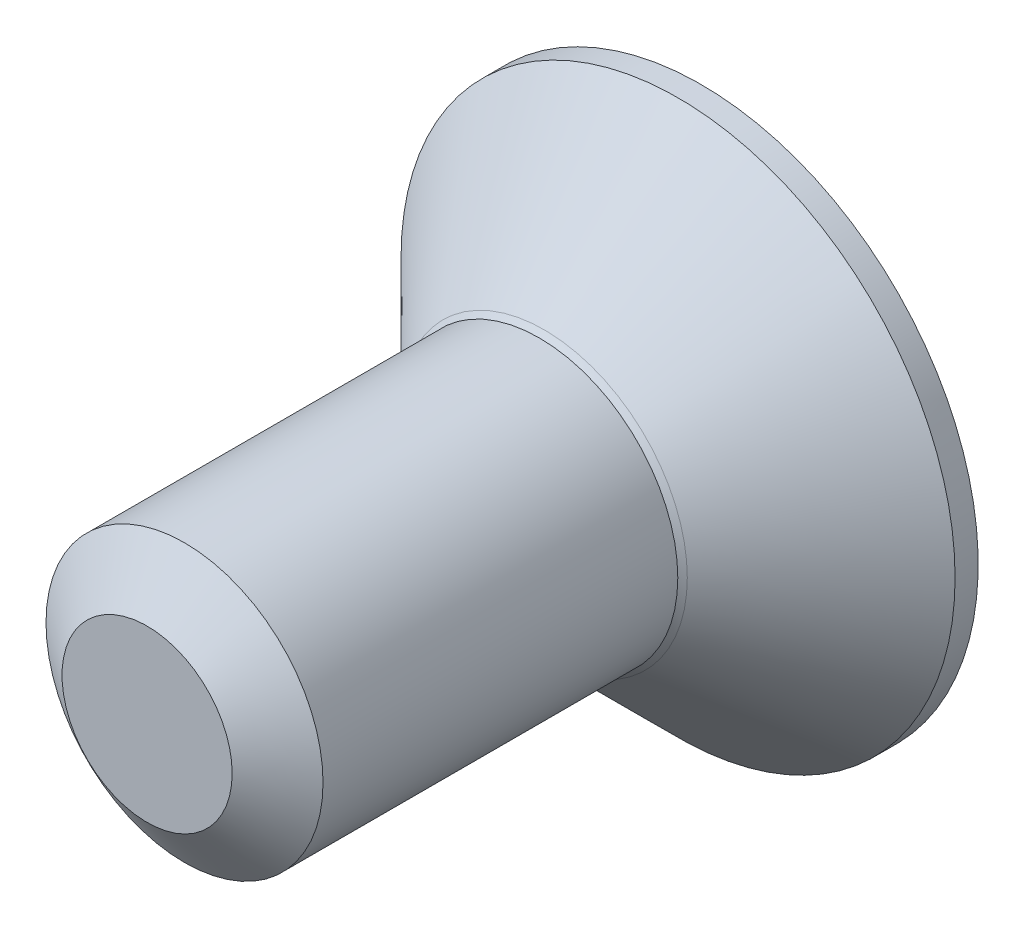
ISO-10303-21;
HEADER;
FILE_DESCRIPTION(('STEP AP214'),'2;1');
FILE_NAME('part.step','',(''),(''),'','','');
FILE_SCHEMA(('AUTOMOTIVE_DESIGN { 1 0 10303 214 1 1 1 1 }'));
ENDSEC;
DATA;
#1=APPLICATION_CONTEXT('core data for automotive mechanical design processes');
#2=APPLICATION_PROTOCOL_DEFINITION('international standard','automotive_design',2000,#1);
#3=PRODUCT_CONTEXT('',#1,'mechanical');
#4=PRODUCT('Part','Part','',(#3));
#5=PRODUCT_RELATED_PRODUCT_CATEGORY('part','',(#4));
#6=PRODUCT_DEFINITION_FORMATION('','',#4);
#7=PRODUCT_DEFINITION_CONTEXT('part definition',#1,'design');
#8=PRODUCT_DEFINITION('design','',#6,#7);
#9=PRODUCT_DEFINITION_SHAPE('','',#8);
#10=(LENGTH_UNIT() NAMED_UNIT(*) SI_UNIT(.MILLI.,.METRE.));
#11=(NAMED_UNIT(*) PLANE_ANGLE_UNIT() SI_UNIT($,.RADIAN.));
#12=(NAMED_UNIT(*) SI_UNIT($,.STERADIAN.) SOLID_ANGLE_UNIT());
#13=UNCERTAINTY_MEASURE_WITH_UNIT(LENGTH_MEASURE(1.E-05),#10,'distance_accuracy_value','');
#14=(GEOMETRIC_REPRESENTATION_CONTEXT(3) GLOBAL_UNCERTAINTY_ASSIGNED_CONTEXT((#13)) GLOBAL_UNIT_ASSIGNED_CONTEXT((#10,
#11,#12)) REPRESENTATION_CONTEXT('',''));
#15=CARTESIAN_POINT('',(0.,0.,0.));
#16=DIRECTION('',(0.,0.,1.));
#17=DIRECTION('',(1.,0.,0.));
#18=AXIS2_PLACEMENT_3D('',#15,#16,#17);
#19=CARTESIAN_POINT('',(0.,0.,-6.));
#20=DIRECTION('',(0.,0.,1.));
#21=DIRECTION('',(1.,0.,0.));
#22=AXIS2_PLACEMENT_3D('',#19,#20,#21);
#23=PLANE('',#22);
#24=CARTESIAN_POINT('',(0.,0.,-6.));
#25=DIRECTION('',(0.,0.,-1.));
#26=DIRECTION('',(-1.,0.,0.));
#27=AXIS2_PLACEMENT_3D('',#24,#25,#26);
#28=CIRCLE('',#27,3.);
#29=CARTESIAN_POINT('',(-3.,0.,-6.));
#30=VERTEX_POINT('',#29);
#31=EDGE_CURVE('E134',#30,#30,#28,.T.);
#32=ORIENTED_EDGE('',*,*,#31,.T.);
#33=EDGE_LOOP('',(#32));
#34=FACE_BOUND('',#33,.T.);
#35=CARTESIAN_POINT('',(0.,0.,-6.));
#36=DIRECTION('',(0.,0.,1.));
#37=DIRECTION('',(1.,0.,0.));
#38=AXIS2_PLACEMENT_3D('',#35,#36,#37);
#39=CIRCLE('',#38,1.15470053837925);
#40=CARTESIAN_POINT('',(0.,-1.15470053837925,-6.));
#41=VERTEX_POINT('',#40);
#42=CARTESIAN_POINT('',(1.,-0.577350269189626,-6.));
#43=VERTEX_POINT('',#42);
#44=EDGE_CURVE('E175',#41,#43,#39,.T.);
#45=ORIENTED_EDGE('',*,*,#44,.T.);
#46=CARTESIAN_POINT('',(1.,0.577350269189626,-6.));
#47=VERTEX_POINT('',#46);
#48=EDGE_CURVE('E177',#43,#47,#39,.T.);
#49=ORIENTED_EDGE('',*,*,#48,.T.);
#50=CARTESIAN_POINT('',(0.,1.15470053837925,-6.));
#51=VERTEX_POINT('',#50);
#52=EDGE_CURVE('E182',#47,#51,#39,.T.);
#53=ORIENTED_EDGE('',*,*,#52,.T.);
#54=CARTESIAN_POINT('',(-1.,0.577350269189626,-6.));
#55=VERTEX_POINT('',#54);
#56=EDGE_CURVE('E54',#51,#55,#39,.T.);
#57=ORIENTED_EDGE('',*,*,#56,.T.);
#58=CARTESIAN_POINT('',(-1.,-0.577350269189626,-6.));
#59=VERTEX_POINT('',#58);
#60=EDGE_CURVE('E61',#55,#59,#39,.T.);
#61=ORIENTED_EDGE('',*,*,#60,.T.);
#62=EDGE_CURVE('E178',#59,#41,#39,.T.);
#63=ORIENTED_EDGE('',*,*,#62,.T.);
#64=EDGE_LOOP('',(#45,#49,#53,#57,#61,#63));
#65=FACE_BOUND('',#64,.T.);
#66=ADVANCED_FACE('F35',(#34,#65),#23,.F.);
#67=CARTESIAN_POINT('',(0.,0.,-6.));
#68=DIRECTION('',(0.,0.,1.));
#69=DIRECTION('',(1.,0.,0.));
#70=AXIS2_PLACEMENT_3D('',#67,#68,#69);
#71=CYLINDRICAL_SURFACE('',#70,1.5);
#72=CARTESIAN_POINT('',(0.,0.,-0.405251783209379));
#73=DIRECTION('',(0.,0.,1.));
#74=DIRECTION('',(1.,0.,0.));
#75=AXIS2_PLACEMENT_3D('',#72,#73,#74);
#76=CIRCLE('',#75,1.5);
#77=CARTESIAN_POINT('',(1.5,0.,-0.405251783209379));
#78=VERTEX_POINT('',#77);
#79=EDGE_CURVE('E48',#78,#78,#76,.T.);
#80=ORIENTED_EDGE('',*,*,#79,.F.);
#81=EDGE_LOOP('',(#80));
#82=FACE_BOUND('',#81,.T.);
#83=CARTESIAN_POINT('',(0.,0.,-4.24707014519123));
#84=DIRECTION('',(0.,0.,1.));
#85=DIRECTION('',(1.,0.,0.));
#86=AXIS2_PLACEMENT_3D('',#83,#84,#85);
#87=CIRCLE('',#86,1.5);
#88=CARTESIAN_POINT('',(1.5,0.,-4.24707014519123));
#89=VERTEX_POINT('',#88);
#90=EDGE_CURVE('E119',#89,#89,#87,.T.);
#91=ORIENTED_EDGE('',*,*,#90,.T.);
#92=EDGE_LOOP('',(#91));
#93=FACE_BOUND('',#92,.T.);
#94=ADVANCED_FACE('F37',(#82,#93),#71,.T.);
#95=CARTESIAN_POINT('',(0.,0.,0.));
#96=DIRECTION('',(0.,0.,-1.));
#97=DIRECTION('',(-1.,0.,0.));
#98=AXIS2_PLACEMENT_3D('',#95,#96,#97);
#99=CONICAL_SURFACE('',#98,0.921240473580834,0.959931088596884);
#100=ORIENTED_EDGE('',*,*,#79,.T.);
#101=EDGE_LOOP('',(#100));
#102=FACE_BOUND('',#101,.T.);
#103=CARTESIAN_POINT('',(0.,0.,0.));
#104=DIRECTION('',(0.,0.,1.));
#105=DIRECTION('',(1.,0.,0.));
#106=AXIS2_PLACEMENT_3D('',#103,#104,#105);
#107=CIRCLE('',#106,0.921240473580834);
#108=CARTESIAN_POINT('',(0.921240473580834,0.,0.));
#109=VERTEX_POINT('',#108);
#110=EDGE_CURVE('E137',#109,#109,#107,.T.);
#111=ORIENTED_EDGE('',*,*,#110,.F.);
#112=EDGE_LOOP('',(#111));
#113=FACE_BOUND('',#112,.T.);
#114=ADVANCED_FACE('F142',(#102,#113),#99,.T.);
#115=CARTESIAN_POINT('',(0.,0.,0.));
#116=DIRECTION('',(0.,0.,1.));
#117=DIRECTION('',(1.,0.,0.));
#118=AXIS2_PLACEMENT_3D('',#115,#116,#117);
#119=PLANE('',#118);
#120=ORIENTED_EDGE('',*,*,#110,.T.);
#121=EDGE_LOOP('',(#120));
#122=FACE_BOUND('',#121,.T.);
#123=ADVANCED_FACE('F153',(#122),#119,.T.);
#124=CARTESIAN_POINT('',(0.,0.,-3.39525046869033));
#125=DIRECTION('',(0.,0.,1.));
#126=DIRECTION('',(1.,0.,0.));
#127=AXIS2_PLACEMENT_3D('',#124,#125,#126);
#128=TOROIDAL_SURFACE('',#127,2.45474953130967,1.27950905772884);
#129=ORIENTED_EDGE('',*,*,#90,.F.);
#130=EDGE_LOOP('',(#129));
#131=FACE_BOUND('',#130,.T.);
#132=CARTESIAN_POINT('',(0.,0.,-4.3));
#133=DIRECTION('',(0.,0.,1.));
#134=DIRECTION('',(1.,0.,0.));
#135=AXIS2_PLACEMENT_3D('',#132,#133,#134);
#136=CIRCLE('',#135,1.55);
#137=CARTESIAN_POINT('',(1.55,0.,-4.3));
#138=VERTEX_POINT('',#137);
#139=EDGE_CURVE('E123',#138,#138,#136,.T.);
#140=ORIENTED_EDGE('',*,*,#139,.T.);
#141=EDGE_LOOP('',(#140));
#142=FACE_BOUND('',#141,.T.);
#143=ADVANCED_FACE('F149',(#131,#142),#128,.F.);
#144=CARTESIAN_POINT('',(0.,0.,-4.3));
#145=DIRECTION('',(0.,0.,-1.));
#146=DIRECTION('',(-1.,0.,0.));
#147=AXIS2_PLACEMENT_3D('',#144,#145,#146);
#148=CYLINDRICAL_SURFACE('',#147,3.);
#149=CARTESIAN_POINT('',(0.,0.,-5.75000000000002));
#150=DIRECTION('',(0.,0.,1.));
#151=DIRECTION('',(1.,0.,0.));
#152=AXIS2_PLACEMENT_3D('',#149,#150,#151);
#153=CIRCLE('',#152,3.);
#154=CARTESIAN_POINT('',(3.,0.,-5.75000000000002));
#155=VERTEX_POINT('',#154);
#156=EDGE_CURVE('E131',#155,#155,#153,.T.);
#157=ORIENTED_EDGE('',*,*,#156,.F.);
#158=EDGE_LOOP('',(#157));
#159=FACE_BOUND('',#158,.T.);
#160=ORIENTED_EDGE('',*,*,#31,.F.);
#161=EDGE_LOOP('',(#160));
#162=FACE_BOUND('',#161,.T.);
#163=ADVANCED_FACE('F152',(#159,#162),#148,.T.);
#164=CARTESIAN_POINT('',(0.,0.,-5.75000000000002));
#165=DIRECTION('',(0.,0.,-1.));
#166=DIRECTION('',(-1.,0.,0.));
#167=AXIS2_PLACEMENT_3D('',#164,#165,#166);
#168=CONICAL_SURFACE('',#167,3.,0.785398163397442);
#169=ORIENTED_EDGE('',*,*,#139,.F.);
#170=EDGE_LOOP('',(#169));
#171=FACE_BOUND('',#170,.T.);
#172=ORIENTED_EDGE('',*,*,#156,.T.);
#173=EDGE_LOOP('',(#172));
#174=FACE_BOUND('',#173,.T.);
#175=ADVANCED_FACE('F157',(#171,#174),#168,.T.);
#176=CARTESIAN_POINT('',(0.,0.,-6.));
#177=DIRECTION('',(0.,0.,-1.));
#178=DIRECTION('',(1.,0.,0.));
#179=AXIS2_PLACEMENT_3D('',#176,#177,#178);
#180=CONICAL_SURFACE('',#179,1.15470053837925,0.78539816339745);
#181=ORIENTED_EDGE('',*,*,#48,.F.);
#182=CARTESIAN_POINT('',(1.,-1.15147208663215,-6.37038567764035));
#183=CARTESIAN_POINT('',(1.,-1.12343448004835,-6.34921991999533));
#184=CARTESIAN_POINT('',(1.,-1.09524064866509,-6.32826169229266));
#185=CARTESIAN_POINT('',(1.,-1.0384771565924,-6.28684602234267));
#186=CARTESIAN_POINT('',(1.,-1.00990740397363,-6.26638870622588));
#187=CARTESIAN_POINT('',(1.,-0.923120894462775,-6.20560479504213));
#188=CARTESIAN_POINT('',(1.,-0.864253173878445,-6.16619222903932));
#189=CARTESIAN_POINT('',(1.,-0.740809858355811,-6.08882066425819));
#190=CARTESIAN_POINT('',(1.,-0.676100255223808,-6.05107303916216));
#191=CARTESIAN_POINT('',(1.,-0.543448939110598,-5.98202458758025));
#192=CARTESIAN_POINT('',(1.,-0.475519112076496,-5.95070202786713));
#193=CARTESIAN_POINT('',(1.,-0.373555850372648,-5.9123817788976));
#194=CARTESIAN_POINT('',(1.,-0.341031989714046,-5.90138359165622));
#195=CARTESIAN_POINT('',(1.,-0.275199079103601,-5.88199834216111));
#196=CARTESIAN_POINT('',(1.,-0.241889975229392,-5.87361145978989));
#197=CARTESIAN_POINT('',(1.,-0.175247517106615,-5.86002522073014));
#198=CARTESIAN_POINT('',(1.,-0.141925568285808,-5.85477079077761));
#199=CARTESIAN_POINT('',(1.,-0.074914436307801,-5.84754868657668));
#200=CARTESIAN_POINT('',(1.,-0.0412251979295627,-5.84558151361391));
#201=CARTESIAN_POINT('',(1.,0.0249580991768643,-5.84508319839111));
#202=CARTESIAN_POINT('',(1.,0.0574512825561959,-5.84643026788357));
#203=CARTESIAN_POINT('',(1.,0.122148505605779,-5.85221648448742));
#204=CARTESIAN_POINT('',(1.,0.154352610033881,-5.85665492064648));
#205=CARTESIAN_POINT('',(1.,0.218799898762755,-5.86845683012285));
#206=CARTESIAN_POINT('',(1.,0.251033743161196,-5.87587054101231));
#207=CARTESIAN_POINT('',(1.,0.314797132241693,-5.89322894246471));
#208=CARTESIAN_POINT('',(1.,0.346326735615183,-5.90317342125094));
#209=CARTESIAN_POINT('',(1.,0.445594187589164,-5.93822348249794));
#210=CARTESIAN_POINT('',(1.,0.511919139313635,-5.9673208582833));
#211=CARTESIAN_POINT('',(1.,0.641453244454049,-6.03201532957715));
#212=CARTESIAN_POINT('',(1.,0.704650132903151,-6.06763577658696));
#213=CARTESIAN_POINT('',(1.,0.825428489916355,-6.14112390118245));
#214=CARTESIAN_POINT('',(1.,0.8831329475932,-6.17879194695385));
#215=CARTESIAN_POINT('',(1.,0.96814885340664,-6.23702285273595));
#216=CARTESIAN_POINT('',(1.,0.996120570074659,-6.25663847554718));
#217=CARTESIAN_POINT('',(1.,1.05168177697804,-6.29638851682867));
#218=CARTESIAN_POINT('',(1.,1.07927136964838,-6.31652279195778));
#219=CARTESIAN_POINT('',(1.,1.10670185312703,-6.33687211882347));
#220=B_SPLINE_CURVE_WITH_KNOTS('',3,(#182,#183,#184,#185,#186,#187,#188,#189,#190,#191,#192,
#193,#194,#195,#196,#197,#198,#199,#200,#201,#202,#203,#204,#205,#206,#207,#208,#209,#210,#211,
#212,#213,#214,#215,#216,#217,#218,#219),.UNSPECIFIED.,.F.,.F.,(4,2,2,2,2,2,2,2,2,2,2,2,2,2,2,2,
2,2,4),(0.,0.10538645910335,0.210799187370249,0.423233611646473,0.647793541035351,
0.871580877910865,0.974493074342054,1.07741235842104,1.17846428216995,1.2795316142844,
1.37694086751269,1.47432772596047,1.57343322813835,1.67253043981296,1.88917353997386,
2.10660791031433,2.31323734235672,2.41572589214523,2.51818641455632),.UNSPECIFIED.);
#221=EDGE_CURVE('E11',#47,#43,#220,.F.);
#222=ORIENTED_EDGE('',*,*,#221,.F.);
#223=EDGE_LOOP('',(#181,#222));
#224=FACE_BOUND('',#223,.T.);
#225=ADVANCED_FACE('F160',(#224),#180,.F.);
#226=ORIENTED_EDGE('',*,*,#44,.F.);
#227=CARTESIAN_POINT('',(1.0002,-0.577234799135788,-6.00011548737261));
#228=CARTESIAN_POINT('',(0.965817404992819,-0.597085599618622,-5.98027793082573));
#229=CARTESIAN_POINT('',(0.930859881860175,-0.617268335009457,-5.96160502063889));
#230=CARTESIAN_POINT('',(0.85957719704391,-0.658423412276686,-5.92741474272316));
#231=CARTESIAN_POINT('',(0.823245249471016,-0.67939967198808,-5.91191640902346));
#232=CARTESIAN_POINT('',(0.749983386196689,-0.721697428470847,-5.88536730714227));
#233=CARTESIAN_POINT('',(0.713072148554586,-0.743008141459637,-5.87424977399693));
#234=CARTESIAN_POINT('',(0.638437270689141,-0.786098608286186,-5.85711986577618));
#235=CARTESIAN_POINT('',(0.600715911891365,-0.807877044942281,-5.85109469746667));
#236=CARTESIAN_POINT('',(0.535707801582067,-0.845409494928863,-5.84566055496749));
#237=CARTESIAN_POINT('',(0.508505628471828,-0.861114676896602,-5.84485693831673));
#238=CARTESIAN_POINT('',(0.454153959330888,-0.892494627706029,-5.84620669941689));
#239=CARTESIAN_POINT('',(0.427004476245125,-0.908169389073954,-5.8483607295472));
#240=CARTESIAN_POINT('',(0.34594372267304,-0.954969836969511,-5.85911697212847));
#241=CARTESIAN_POINT('',(0.292435859021573,-0.985862616452447,-5.87201455641536));
#242=CARTESIAN_POINT('',(0.198523934856569,-1.04008269114923,-5.90314073060218));
#243=CARTESIAN_POINT('',(0.157679476328166,-1.06366425027551,-5.91973779770184));
#244=CARTESIAN_POINT('',(0.0775903626180564,-1.1099037216352,-5.95712492468529));
#245=CARTESIAN_POINT('',(0.0383409891295623,-1.1325643579843,-5.9779013418174));
#246=CARTESIAN_POINT('',(-0.000199999999999796,-1.15481600843309,-6.00011548737261));
#247=B_SPLINE_CURVE_WITH_KNOTS('',3,(#227,#228,#229,#230,#231,#232,#233,#234,#235,#236,#237,
#238,#239,#240,#241,#242,#243,#244,#245,#246),.UNSPECIFIED.,.F.,.F.,(4,2,2,2,2,2,2,2,2,4),(0.,
0.133237676828559,0.26725222983449,0.399137076269299,0.530689603280767,0.624814864263845,
0.718960890149132,0.907306626112096,1.05710100361789,1.20641411519286),.UNSPECIFIED.);
#248=EDGE_CURVE('E184',#43,#41,#247,.T.);
#249=ORIENTED_EDGE('',*,*,#248,.F.);
#250=EDGE_LOOP('',(#226,#249));
#251=FACE_BOUND('',#250,.T.);
#252=ADVANCED_FACE('F202',(#251),#180,.F.);
#253=ORIENTED_EDGE('',*,*,#62,.F.);
#254=CARTESIAN_POINT('',(0.000199999999999922,-1.15481600843309,-6.00011548737261));
#255=CARTESIAN_POINT('',(-0.0341825950071808,-1.13496520795026,-5.98027793082573));
#256=CARTESIAN_POINT('',(-0.069140118139825,-1.11478247255942,-5.96160502063889));
#257=CARTESIAN_POINT('',(-0.14042280295609,-1.07362739529219,-5.92741474272316));
#258=CARTESIAN_POINT('',(-0.176754750528984,-1.0526511355808,-5.91191640902346));
#259=CARTESIAN_POINT('',(-0.250016613803311,-1.01035337909803,-5.88536730714227));
#260=CARTESIAN_POINT('',(-0.286927851445414,-0.989042666109241,-5.87424977399693));
#261=CARTESIAN_POINT('',(-0.361562729310859,-0.945952199282691,-5.85711986577618));
#262=CARTESIAN_POINT('',(-0.399284088108636,-0.924173762626597,-5.85109469746667));
#263=CARTESIAN_POINT('',(-0.464292198417933,-0.886641312640015,-5.84566055496749));
#264=CARTESIAN_POINT('',(-0.491494371528172,-0.870936130672276,-5.84485693831673));
#265=CARTESIAN_POINT('',(-0.545846040669112,-0.839556179862849,-5.84620669941689));
#266=CARTESIAN_POINT('',(-0.572995523754876,-0.823881418494924,-5.8483607295472));
#267=CARTESIAN_POINT('',(-0.65405627732696,-0.777080970599367,-5.85911697212847));
#268=CARTESIAN_POINT('',(-0.707564140978427,-0.74618819111643,-5.87201455641536));
#269=CARTESIAN_POINT('',(-0.801476065143431,-0.69196811641965,-5.90314073060218));
#270=CARTESIAN_POINT('',(-0.842320523671834,-0.668386557293372,-5.91973779770184));
#271=CARTESIAN_POINT('',(-0.922409637381943,-0.622147085933682,-5.95712492468529));
#272=CARTESIAN_POINT('',(-0.961659010870437,-0.599486449584575,-5.9779013418174));
#273=CARTESIAN_POINT('',(-1.0002,-0.577234799135788,-6.00011548737261));
#274=B_SPLINE_CURVE_WITH_KNOTS('',3,(#254,#255,#256,#257,#258,#259,#260,#261,#262,#263,#264,
#265,#266,#267,#268,#269,#270,#271,#272,#273),.UNSPECIFIED.,.F.,.F.,(4,2,2,2,2,2,2,2,2,4),(0.,
0.133237676828559,0.26725222983449,0.3991370762693,0.530689603280768,0.624814864263846,
0.718960890149133,0.907306626112097,1.05710100361789,1.20641411519286),.UNSPECIFIED.);
#275=EDGE_CURVE('E191',#41,#59,#274,.T.);
#276=ORIENTED_EDGE('',*,*,#275,.F.);
#277=EDGE_LOOP('',(#253,#276));
#278=FACE_BOUND('',#277,.T.);
#279=ADVANCED_FACE('F265',(#278),#180,.F.);
#280=ORIENTED_EDGE('',*,*,#60,.F.);
#281=CARTESIAN_POINT('',(-1.,-1.15147208646462,-6.37038567751386));
#282=CARTESIAN_POINT('',(-1.,-1.12343447988552,-6.34921991987371));
#283=CARTESIAN_POINT('',(-1.,-1.09524064850697,-6.32826169217591));
#284=CARTESIAN_POINT('',(-1.,-1.03847715644376,-6.28684602223562));
#285=CARTESIAN_POINT('',(-1.,-1.00990740382975,-6.26638870612366));
#286=CARTESIAN_POINT('',(-1.,-0.923120894333477,-6.20560479495451));
#287=CARTESIAN_POINT('',(-1.,-0.864253173759059,-6.1661922289614));
#288=CARTESIAN_POINT('',(-1.,-0.740809858258045,-6.0888206642002));
#289=CARTESIAN_POINT('',(-1.,-0.676100255137807,-6.05107303911434));
#290=CARTESIAN_POINT('',(-1.,-0.543448939049124,-5.98202458755129));
#291=CARTESIAN_POINT('',(-1.,-0.475519112027779,-5.95070202784686));
#292=CARTESIAN_POINT('',(-1.,-0.373555850333529,-5.91238177888379));
#293=CARTESIAN_POINT('',(-1.,-0.341031989670908,-5.90138359164216));
#294=CARTESIAN_POINT('',(-1.,-0.275199079052294,-5.88199834214736));
#295=CARTESIAN_POINT('',(-1.,-0.241889975173933,-5.8736114597767));
#296=CARTESIAN_POINT('',(-1.,-0.175247517042993,-5.86002522071902));
#297=CARTESIAN_POINT('',(-1.,-0.141925568218176,-5.85477079076797));
#298=CARTESIAN_POINT('',(-1.,-0.0749144362322796,-5.84754868657089));
#299=CARTESIAN_POINT('',(-1.,-0.0412251978501624,-5.84558151361051));
#300=CARTESIAN_POINT('',(-1.,0.0249580992634203,-5.84508319839316));
#301=CARTESIAN_POINT('',(-1.,0.0574512826460386,-5.84643026788863));
#302=CARTESIAN_POINT('',(-1.,0.122148505701866,-5.85221648449898));
#303=CARTESIAN_POINT('',(-1.,0.154352610132926,-5.85665492066153));
#304=CARTESIAN_POINT('',(-1.,0.218799898867639,-5.8684568301452));
#305=CARTESIAN_POINT('',(-1.,0.251033743268953,-5.87587054103851));
#306=CARTESIAN_POINT('',(-1.,0.314797132354918,-5.89322894249868));
#307=CARTESIAN_POINT('',(-1.,0.346326735731004,-5.90317342128883));
#308=CARTESIAN_POINT('',(-1.,0.445594187730204,-5.93822348255433));
#309=CARTESIAN_POINT('',(-1.,0.511919139476036,-5.96732085835672));
#310=CARTESIAN_POINT('',(-1.,0.641453244657531,-6.0320153296865));
#311=CARTESIAN_POINT('',(-1.,0.704650133126343,-6.06763577671524));
#312=CARTESIAN_POINT('',(-1.,0.825428490174985,-6.14112390134693));
#313=CARTESIAN_POINT('',(-1.,0.883132947867683,-6.17879194713546));
#314=CARTESIAN_POINT('',(-1.,0.968148853704564,-6.23702285294316));
#315=CARTESIAN_POINT('',(-1.,0.996120570380284,-6.25663847576285));
#316=CARTESIAN_POINT('',(-1.,1.05168177729901,-6.29638851706127));
#317=CARTESIAN_POINT('',(-1.,1.079271369977,-6.31652279219883));
#318=CARTESIAN_POINT('',(-1.,1.10670185346329,-6.33687211907297));
#319=B_SPLINE_CURVE_WITH_KNOTS('',3,(#281,#282,#283,#284,#285,#286,#287,#288,#289,#290,#291,
#292,#293,#294,#295,#296,#297,#298,#299,#300,#301,#302,#303,#304,#305,#306,#307,#308,#309,#310,
#311,#312,#313,#314,#315,#316,#317,#318),.UNSPECIFIED.,.F.,.F.,(4,2,2,2,2,2,2,2,2,2,2,2,2,2,2,2,
2,2,4),(0.,0.105386459083291,0.210799187330125,0.423233611565469,0.647793540908504,
0.871580877738609,0.974493074181421,1.07741235827201,1.17846428203205,1.27953161415762,
1.3769408673961,1.47432772585408,1.57343322804293,1.67253043972851,1.88917353996827,
2.10660791038813,2.31323734249843,2.41572589232045,2.51818641476503),.UNSPECIFIED.);
#320=EDGE_CURVE('E211',#59,#55,#319,.T.);
#321=ORIENTED_EDGE('',*,*,#320,.F.);
#322=EDGE_LOOP('',(#280,#321));
#323=FACE_BOUND('',#322,.T.);
#324=ADVANCED_FACE('F271',(#323),#180,.F.);
#325=ORIENTED_EDGE('',*,*,#56,.F.);
#326=CARTESIAN_POINT('',(-1.0002,0.577234799135789,-6.00011548737261));
#327=CARTESIAN_POINT('',(-0.965817404992819,0.597085599618622,-5.98027793082573));
#328=CARTESIAN_POINT('',(-0.930859881860175,0.617268335009457,-5.96160502063889));
#329=CARTESIAN_POINT('',(-0.85957719704391,0.658423412276687,-5.92741474272316));
#330=CARTESIAN_POINT('',(-0.823245249471016,0.67939967198808,-5.91191640902346));
#331=CARTESIAN_POINT('',(-0.749983386196689,0.721697428470847,-5.88536730714227));
#332=CARTESIAN_POINT('',(-0.713072148554586,0.743008141459637,-5.87424977399693));
#333=CARTESIAN_POINT('',(-0.638437270689141,0.786098608286187,-5.85711986577618));
#334=CARTESIAN_POINT('',(-0.600715911891364,0.807877044942281,-5.85109469746667));
#335=CARTESIAN_POINT('',(-0.535707801582067,0.845409494928863,-5.84566055496749));
#336=CARTESIAN_POINT('',(-0.508505628471828,0.861114676896602,-5.84485693831673));
#337=CARTESIAN_POINT('',(-0.454153959330888,0.892494627706029,-5.84620669941689));
#338=CARTESIAN_POINT('',(-0.427004476245124,0.908169389073954,-5.8483607295472));
#339=CARTESIAN_POINT('',(-0.34594372267304,0.954969836969511,-5.85911697212847));
#340=CARTESIAN_POINT('',(-0.292435859021573,0.985862616452448,-5.87201455641536));
#341=CARTESIAN_POINT('',(-0.198523934856568,1.04008269114923,-5.90314073060218));
#342=CARTESIAN_POINT('',(-0.157679476328166,1.06366425027551,-5.91973779770184));
#343=CARTESIAN_POINT('',(-0.0775903626180567,1.1099037216352,-5.95712492468529));
#344=CARTESIAN_POINT('',(-0.0383409891295629,1.1325643579843,-5.9779013418174));
#345=CARTESIAN_POINT('',(0.000199999999999143,1.15481600843309,-6.00011548737261));
#346=B_SPLINE_CURVE_WITH_KNOTS('',3,(#326,#327,#328,#329,#330,#331,#332,#333,#334,#335,#336,
#337,#338,#339,#340,#341,#342,#343,#344,#345),.UNSPECIFIED.,.F.,.F.,(4,2,2,2,2,2,2,2,2,4),(0.,
0.133237676828559,0.26725222983449,0.3991370762693,0.530689603280767,0.624814864263845,
0.718960890149133,0.907306626112097,1.05710100361789,1.20641411519286),.UNSPECIFIED.);
#347=EDGE_CURVE('E118',#55,#51,#346,.T.);
#348=ORIENTED_EDGE('',*,*,#347,.F.);
#349=EDGE_LOOP('',(#325,#348));
#350=FACE_BOUND('',#349,.T.);
#351=ADVANCED_FACE('F278',(#350),#180,.F.);
#352=ORIENTED_EDGE('',*,*,#52,.F.);
#353=CARTESIAN_POINT('',(-0.000200000000000627,1.15481600843309,-6.00011548737261));
#354=CARTESIAN_POINT('',(0.03418259500718,1.13496520795026,-5.98027793082573));
#355=CARTESIAN_POINT('',(0.0691401181398243,1.11478247255942,-5.96160502063889));
#356=CARTESIAN_POINT('',(0.140422802956089,1.07362739529219,-5.92741474272316));
#357=CARTESIAN_POINT('',(0.176754750528983,1.0526511355808,-5.91191640902346));
#358=CARTESIAN_POINT('',(0.25001661380331,1.01035337909803,-5.88536730714227));
#359=CARTESIAN_POINT('',(0.286927851445414,0.989042666109241,-5.87424977399693));
#360=CARTESIAN_POINT('',(0.361562729310859,0.945952199282691,-5.85711986577618));
#361=CARTESIAN_POINT('',(0.399284088108635,0.924173762626597,-5.85109469746667));
#362=CARTESIAN_POINT('',(0.464292198417933,0.886641312640015,-5.84566055496749));
#363=CARTESIAN_POINT('',(0.491494371528171,0.870936130672276,-5.84485693831673));
#364=CARTESIAN_POINT('',(0.545846040669111,0.839556179862849,-5.84620669941689));
#365=CARTESIAN_POINT('',(0.572995523754875,0.823881418494924,-5.8483607295472));
#366=CARTESIAN_POINT('',(0.654056277326959,0.777080970599367,-5.85911697212847));
#367=CARTESIAN_POINT('',(0.707564140978427,0.746188191116431,-5.87201455641536));
#368=CARTESIAN_POINT('',(0.801476065143431,0.69196811641965,-5.90314073060218));
#369=CARTESIAN_POINT('',(0.842320523671834,0.668386557293372,-5.91973779770184));
#370=CARTESIAN_POINT('',(0.922409637381943,0.622147085933681,-5.95712492468529));
#371=CARTESIAN_POINT('',(0.961659010870437,0.599486449584575,-5.9779013418174));
#372=CARTESIAN_POINT('',(1.0002,0.577234799135788,-6.00011548737261));
#373=B_SPLINE_CURVE_WITH_KNOTS('',3,(#353,#354,#355,#356,#357,#358,#359,#360,#361,#362,#363,
#364,#365,#366,#367,#368,#369,#370,#371,#372),.UNSPECIFIED.,.F.,.F.,(4,2,2,2,2,2,2,2,2,4),(0.,
0.13323767682856,0.26725222983449,0.3991370762693,0.530689603280768,0.624814864263846,
0.718960890149133,0.907306626112097,1.05710100361789,1.20641411519286),.UNSPECIFIED.);
#374=EDGE_CURVE('E114',#51,#47,#373,.T.);
#375=ORIENTED_EDGE('',*,*,#374,.F.);
#376=EDGE_LOOP('',(#352,#375));
#377=FACE_BOUND('',#376,.T.);
#378=ADVANCED_FACE('F204',(#377),#180,.F.);
#379=CARTESIAN_POINT('',(-1.,1.73205080756888,-4.5));
#380=DIRECTION('',(0.,0.,1.));
#381=DIRECTION('',(1.,0.,0.));
#382=AXIS2_PLACEMENT_3D('',#379,#380,#381);
#383=PLANE('',#382);
#384=DIRECTION('',(-0.866025403784439,0.5,0.));
#385=VECTOR('',#384,1.);
#386=CARTESIAN_POINT('',(1.,0.577350269189626,-4.5));
#387=LINE('',#386,#385);
#388=CARTESIAN_POINT('',(1.,0.577350269189626,-4.5));
#389=VERTEX_POINT('',#388);
#390=CARTESIAN_POINT('',(0.,1.15470053837925,-4.5));
#391=VERTEX_POINT('',#390);
#392=EDGE_CURVE('E98',#389,#391,#387,.T.);
#393=ORIENTED_EDGE('',*,*,#392,.F.);
#394=DIRECTION('',(0.,1.,0.));
#395=VECTOR('',#394,1.);
#396=CARTESIAN_POINT('',(1.,-0.577350269189626,-4.5));
#397=LINE('',#396,#395);
#398=CARTESIAN_POINT('',(1.,-0.577350269189626,-4.5));
#399=VERTEX_POINT('',#398);
#400=EDGE_CURVE('E396',#399,#389,#397,.T.);
#401=ORIENTED_EDGE('',*,*,#400,.F.);
#402=DIRECTION('',(0.866025403784439,0.5,0.));
#403=VECTOR('',#402,1.);
#404=CARTESIAN_POINT('',(0.,-1.15470053837925,-4.5));
#405=LINE('',#404,#403);
#406=CARTESIAN_POINT('',(0.,-1.15470053837925,-4.5));
#407=VERTEX_POINT('',#406);
#408=EDGE_CURVE('E393',#407,#399,#405,.T.);
#409=ORIENTED_EDGE('',*,*,#408,.F.);
#410=DIRECTION('',(0.866025403784439,-0.5,0.));
#411=VECTOR('',#410,1.);
#412=CARTESIAN_POINT('',(-1.,-0.577350269189626,-4.5));
#413=LINE('',#412,#411);
#414=CARTESIAN_POINT('',(-1.,-0.577350269189626,-4.5));
#415=VERTEX_POINT('',#414);
#416=EDGE_CURVE('E401',#415,#407,#413,.T.);
#417=ORIENTED_EDGE('',*,*,#416,.F.);
#418=DIRECTION('',(0.,-1.,0.));
#419=VECTOR('',#418,1.);
#420=CARTESIAN_POINT('',(-1.,0.577350269189626,-4.5));
#421=LINE('',#420,#419);
#422=CARTESIAN_POINT('',(-1.,0.577350269189626,-4.5));
#423=VERTEX_POINT('',#422);
#424=EDGE_CURVE('E100',#423,#415,#421,.T.);
#425=ORIENTED_EDGE('',*,*,#424,.F.);
#426=DIRECTION('',(-0.866025403784439,-0.5,0.));
#427=VECTOR('',#426,1.);
#428=CARTESIAN_POINT('',(0.,1.15470053837925,-4.5));
#429=LINE('',#428,#427);
#430=EDGE_CURVE('E94',#391,#423,#429,.T.);
#431=ORIENTED_EDGE('',*,*,#430,.F.);
#432=EDGE_LOOP('',(#393,#401,#409,#417,#425,#431));
#433=FACE_BOUND('',#432,.T.);
#434=ADVANCED_FACE('F96',(#433),#383,.F.);
#435=CARTESIAN_POINT('',(1.,-0.577350269189626,-4.5));
#436=DIRECTION('',(-1.,0.,0.));
#437=DIRECTION('',(0.,-1.,0.));
#438=AXIS2_PLACEMENT_3D('',#435,#436,#437);
#439=PLANE('',#438);
#440=DIRECTION('',(0.,0.,-1.));
#441=VECTOR('',#440,1.);
#442=CARTESIAN_POINT('',(1.,0.577350269189626,-4.5));
#443=LINE('',#442,#441);
#444=EDGE_CURVE('E113',#389,#47,#443,.T.);
#445=ORIENTED_EDGE('',*,*,#444,.T.);
#446=ORIENTED_EDGE('',*,*,#221,.T.);
#447=DIRECTION('',(0.,0.,-1.));
#448=VECTOR('',#447,1.);
#449=CARTESIAN_POINT('',(1.,-0.577350269189626,-4.5));
#450=LINE('',#449,#448);
#451=EDGE_CURVE('E389',#399,#43,#450,.T.);
#452=ORIENTED_EDGE('',*,*,#451,.F.);
#453=ORIENTED_EDGE('',*,*,#400,.T.);
#454=EDGE_LOOP('',(#445,#446,#452,#453));
#455=FACE_BOUND('',#454,.T.);
#456=ADVANCED_FACE('F295',(#455),#439,.T.);
#457=CARTESIAN_POINT('',(0.,-1.15470053837925,-4.5));
#458=DIRECTION('',(-0.5,0.866025403784439,0.));
#459=DIRECTION('',(-0.866025403784439,-0.5,0.));
#460=AXIS2_PLACEMENT_3D('',#457,#458,#459);
#461=PLANE('',#460);
#462=ORIENTED_EDGE('',*,*,#451,.T.);
#463=ORIENTED_EDGE('',*,*,#248,.T.);
#464=DIRECTION('',(0.,0.,-1.));
#465=VECTOR('',#464,1.);
#466=CARTESIAN_POINT('',(0.,-1.15470053837925,-4.5));
#467=LINE('',#466,#465);
#468=EDGE_CURVE('E384',#407,#41,#467,.T.);
#469=ORIENTED_EDGE('',*,*,#468,.F.);
#470=ORIENTED_EDGE('',*,*,#408,.T.);
#471=EDGE_LOOP('',(#462,#463,#469,#470));
#472=FACE_BOUND('',#471,.T.);
#473=ADVANCED_FACE('F197',(#472),#461,.T.);
#474=CARTESIAN_POINT('',(-1.,-0.577350269189626,-4.5));
#475=DIRECTION('',(0.5,0.866025403784438,0.));
#476=DIRECTION('',(-0.866025403784439,0.5,0.));
#477=AXIS2_PLACEMENT_3D('',#474,#475,#476);
#478=PLANE('',#477);
#479=ORIENTED_EDGE('',*,*,#468,.T.);
#480=ORIENTED_EDGE('',*,*,#275,.T.);
#481=DIRECTION('',(0.,0.,-1.));
#482=VECTOR('',#481,1.);
#483=CARTESIAN_POINT('',(-1.,-0.577350269189626,-4.5));
#484=LINE('',#483,#482);
#485=EDGE_CURVE('E125',#415,#59,#484,.T.);
#486=ORIENTED_EDGE('',*,*,#485,.F.);
#487=ORIENTED_EDGE('',*,*,#416,.T.);
#488=EDGE_LOOP('',(#479,#480,#486,#487));
#489=FACE_BOUND('',#488,.T.);
#490=ADVANCED_FACE('F306',(#489),#478,.T.);
#491=CARTESIAN_POINT('',(-1.,0.577350269189626,-4.5));
#492=DIRECTION('',(1.,0.,0.));
#493=DIRECTION('',(0.,1.,0.));
#494=AXIS2_PLACEMENT_3D('',#491,#492,#493);
#495=PLANE('',#494);
#496=ORIENTED_EDGE('',*,*,#485,.T.);
#497=ORIENTED_EDGE('',*,*,#320,.T.);
#498=DIRECTION('',(0.,0.,-1.));
#499=VECTOR('',#498,1.);
#500=CARTESIAN_POINT('',(-1.,0.577350269189626,-4.5));
#501=LINE('',#500,#499);
#502=EDGE_CURVE('E120',#423,#55,#501,.T.);
#503=ORIENTED_EDGE('',*,*,#502,.F.);
#504=ORIENTED_EDGE('',*,*,#424,.T.);
#505=EDGE_LOOP('',(#496,#497,#503,#504));
#506=FACE_BOUND('',#505,.T.);
#507=ADVANCED_FACE('F227',(#506),#495,.T.);
#508=CARTESIAN_POINT('',(0.,1.15470053837925,-4.5));
#509=DIRECTION('',(0.5,-0.866025403784439,0.));
#510=DIRECTION('',(0.866025403784439,0.5,0.));
#511=AXIS2_PLACEMENT_3D('',#508,#509,#510);
#512=PLANE('',#511);
#513=ORIENTED_EDGE('',*,*,#502,.T.);
#514=ORIENTED_EDGE('',*,*,#347,.T.);
#515=DIRECTION('',(0.,0.,-1.));
#516=VECTOR('',#515,1.);
#517=CARTESIAN_POINT('',(0.,1.15470053837925,-4.5));
#518=LINE('',#517,#516);
#519=EDGE_CURVE('E111',#391,#51,#518,.T.);
#520=ORIENTED_EDGE('',*,*,#519,.F.);
#521=ORIENTED_EDGE('',*,*,#430,.T.);
#522=EDGE_LOOP('',(#513,#514,#520,#521));
#523=FACE_BOUND('',#522,.T.);
#524=ADVANCED_FACE('F117',(#523),#512,.T.);
#525=CARTESIAN_POINT('',(1.,0.577350269189626,-4.5));
#526=DIRECTION('',(-0.5,-0.866025403784439,0.));
#527=DIRECTION('',(0.866025403784439,-0.5,0.));
#528=AXIS2_PLACEMENT_3D('',#525,#526,#527);
#529=PLANE('',#528);
#530=ORIENTED_EDGE('',*,*,#519,.T.);
#531=ORIENTED_EDGE('',*,*,#374,.T.);
#532=ORIENTED_EDGE('',*,*,#444,.F.);
#533=ORIENTED_EDGE('',*,*,#392,.T.);
#534=EDGE_LOOP('',(#530,#531,#532,#533));
#535=FACE_BOUND('',#534,.T.);
#536=ADVANCED_FACE('F109',(#535),#529,.T.);
#537=CLOSED_SHELL('',(#66,#94,#114,#123,#143,#163,#175,#225,#252,#279,#324,#351,#378,#434,#456,
#473,#490,#507,#524,#536));
#538=MANIFOLD_SOLID_BREP('B2',#537);
#539=ADVANCED_BREP_SHAPE_REPRESENTATION('',(#18,#538),#14);
#540=SHAPE_DEFINITION_REPRESENTATION(#9,#539);
ENDSEC;
END-ISO-10303-21;
